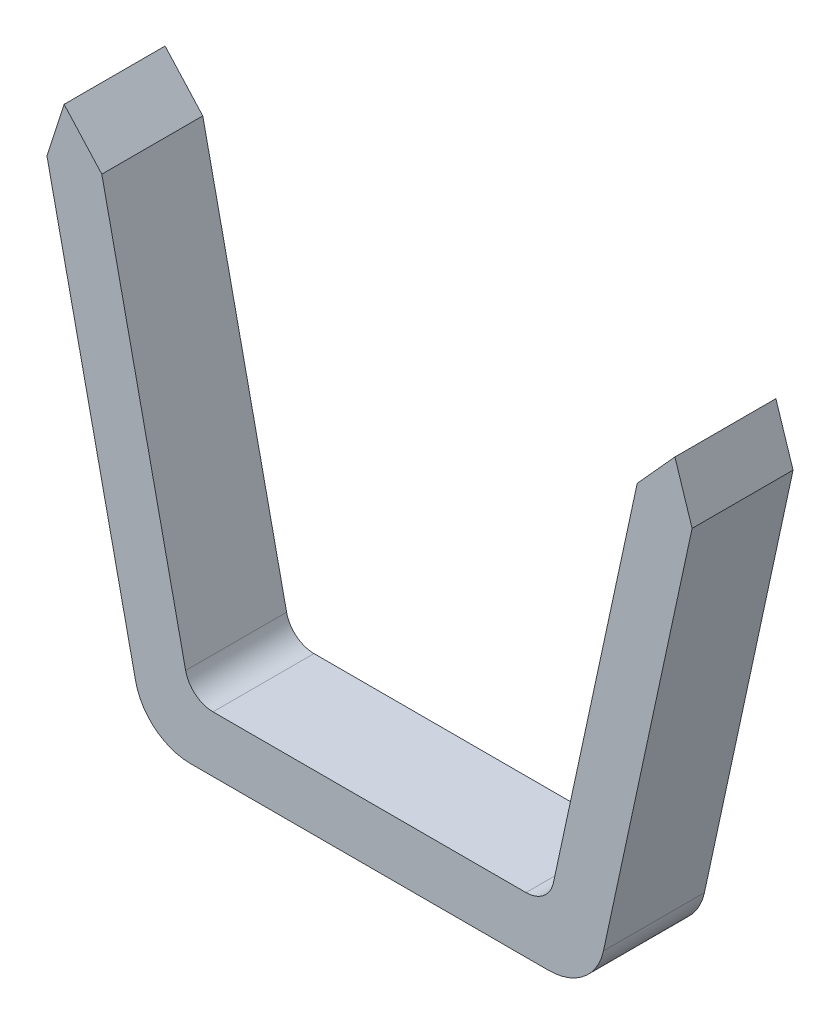
ISO-10303-21;
HEADER;
FILE_DESCRIPTION(('STEP AP214'),'2;1');
FILE_NAME('part.step','',(''),(''),'','','');
FILE_SCHEMA(('AUTOMOTIVE_DESIGN { 1 0 10303 214 1 1 1 1 }'));
ENDSEC;
DATA;
#1=APPLICATION_CONTEXT('core data for automotive mechanical design processes');
#2=APPLICATION_PROTOCOL_DEFINITION('international standard','automotive_design',2000,#1);
#3=PRODUCT_CONTEXT('',#1,'mechanical');
#4=PRODUCT('Part','Part','',(#3));
#5=PRODUCT_RELATED_PRODUCT_CATEGORY('part','',(#4));
#6=PRODUCT_DEFINITION_FORMATION('','',#4);
#7=PRODUCT_DEFINITION_CONTEXT('part definition',#1,'design');
#8=PRODUCT_DEFINITION('design','',#6,#7);
#9=PRODUCT_DEFINITION_SHAPE('','',#8);
#10=(LENGTH_UNIT() NAMED_UNIT(*) SI_UNIT(.MILLI.,.METRE.));
#11=(NAMED_UNIT(*) PLANE_ANGLE_UNIT() SI_UNIT($,.RADIAN.));
#12=(NAMED_UNIT(*) SI_UNIT($,.STERADIAN.) SOLID_ANGLE_UNIT());
#13=UNCERTAINTY_MEASURE_WITH_UNIT(LENGTH_MEASURE(1.E-05),#10,'distance_accuracy_value','');
#14=(GEOMETRIC_REPRESENTATION_CONTEXT(3) GLOBAL_UNCERTAINTY_ASSIGNED_CONTEXT((#13)) GLOBAL_UNIT_ASSIGNED_CONTEXT((#10,
#11,#12)) REPRESENTATION_CONTEXT('',''));
#15=CARTESIAN_POINT('',(0.,0.,0.));
#16=DIRECTION('',(0.,0.,1.));
#17=DIRECTION('',(1.,0.,0.));
#18=AXIS2_PLACEMENT_3D('',#15,#16,#17);
#19=CARTESIAN_POINT('',(-31.9298733487398,-112.5,18.));
#20=DIRECTION('',(0.,0.,1.));
#21=DIRECTION('',(1.,0.,0.));
#22=AXIS2_PLACEMENT_3D('',#19,#20,#21);
#23=PLANE('',#22);
#24=DIRECTION('',(0.306672532909785,-0.951815085801174,0.));
#25=VECTOR('',#24,1.);
#26=CARTESIAN_POINT('',(54.4443390688109,-31.9720104377862,18.));
#27=LINE('',#26,#25);
#28=CARTESIAN_POINT('',(54.4443390688109,-31.9720104377862,18.));
#29=VERTEX_POINT('',#28);
#30=CARTESIAN_POINT('',(57.5063561450649,-41.4755483598365,18.));
#31=VERTEX_POINT('',#30);
#32=EDGE_CURVE('E147',#29,#31,#27,.T.);
#33=ORIENTED_EDGE('',*,*,#32,.F.);
#34=DIRECTION('',(0.670959777554308,0.741493747043273,0.));
#35=VECTOR('',#34,1.);
#36=CARTESIAN_POINT('',(47.7244032118376,-39.3983727700264,18.));
#37=LINE('',#36,#35);
#38=CARTESIAN_POINT('',(47.7244032118376,-39.3983727700264,18.));
#39=VERTEX_POINT('',#38);
#40=EDGE_CURVE('E261',#39,#29,#37,.T.);
#41=ORIENTED_EDGE('',*,*,#40,.F.);
#42=DIRECTION('',(0.211189373172623,0.977445164016353,0.));
#43=VECTOR('',#42,1.);
#44=CARTESIAN_POINT('',(31.9298733487398,-112.5,18.));
#45=LINE('',#44,#43);
#46=CARTESIAN_POINT('',(32.7820358431914,-108.555946865863,18.));
#47=VERTEX_POINT('',#46);
#48=EDGE_CURVE('E221',#47,#39,#45,.T.);
#49=ORIENTED_EDGE('',*,*,#48,.F.);
#50=CARTESIAN_POINT('',(27.8948100231097,-107.5,18.));
#51=DIRECTION('',(0.,0.,1.));
#52=DIRECTION('',(1.,0.,0.));
#53=AXIS2_PLACEMENT_3D('',#50,#51,#52);
#54=CIRCLE('',#53,5.);
#55=CARTESIAN_POINT('',(27.8948100231097,-112.5,18.));
#56=VERTEX_POINT('',#55);
#57=EDGE_CURVE('E196',#47,#56,#54,.F.);
#58=ORIENTED_EDGE('',*,*,#57,.T.);
#59=DIRECTION('',(1.,0.,0.));
#60=VECTOR('',#59,1.);
#61=CARTESIAN_POINT('',(-31.9298733487398,-112.5,18.));
#62=LINE('',#61,#60);
#63=CARTESIAN_POINT('',(-27.8948100231097,-112.5,18.));
#64=VERTEX_POINT('',#63);
#65=EDGE_CURVE('E218',#64,#56,#62,.T.);
#66=ORIENTED_EDGE('',*,*,#65,.F.);
#67=CARTESIAN_POINT('',(-27.8948100231097,-107.5,18.));
#68=DIRECTION('',(0.,0.,1.));
#69=DIRECTION('',(1.,0.,0.));
#70=AXIS2_PLACEMENT_3D('',#67,#68,#69);
#71=CIRCLE('',#70,5.);
#72=CARTESIAN_POINT('',(-32.7820358431915,-108.555946865863,18.));
#73=VERTEX_POINT('',#72);
#74=EDGE_CURVE('E11',#64,#73,#71,.F.);
#75=ORIENTED_EDGE('',*,*,#74,.T.);
#76=DIRECTION('',(0.211189373172623,-0.977445164016353,0.));
#77=VECTOR('',#76,1.);
#78=CARTESIAN_POINT('',(-31.9298733487398,-112.5,18.));
#79=LINE('',#78,#77);
#80=CARTESIAN_POINT('',(-47.7236876934698,-39.4016843948391,18.));
#81=VERTEX_POINT('',#80);
#82=EDGE_CURVE('E217',#81,#73,#79,.T.);
#83=ORIENTED_EDGE('',*,*,#82,.F.);
#84=DIRECTION('',(0.67089697040122,-0.741550574881083,0.));
#85=VECTOR('',#84,1.);
#86=CARTESIAN_POINT('',(-54.4439824625953,-31.9736609139237,18.));
#87=LINE('',#86,#85);
#88=CARTESIAN_POINT('',(-54.4439824625953,-31.9736609139237,18.));
#89=VERTEX_POINT('',#88);
#90=EDGE_CURVE('E50',#89,#81,#87,.T.);
#91=ORIENTED_EDGE('',*,*,#90,.F.);
#92=DIRECTION('',(0.306753150837407,0.95178910713,0.));
#93=VECTOR('',#92,1.);
#94=CARTESIAN_POINT('',(-57.5063561450649,-41.4755483598365,18.));
#95=LINE('',#94,#93);
#96=CARTESIAN_POINT('',(-57.5063561450649,-41.4755483598365,18.));
#97=VERTEX_POINT('',#96);
#98=EDGE_CURVE('E258',#97,#89,#95,.T.);
#99=ORIENTED_EDGE('',*,*,#98,.F.);
#100=DIRECTION('',(0.211189373172623,-0.977445164016353,0.));
#101=VECTOR('',#100,1.);
#102=CARTESIAN_POINT('',(-73.3083873012264,31.6607970120533,18.));
#103=LINE('',#102,#101);
#104=CARTESIAN_POINT('',(-41.7043249889033,-114.611893731726,18.));
#105=VERTEX_POINT('',#104);
#106=EDGE_CURVE('E155',#97,#105,#103,.T.);
#107=ORIENTED_EDGE('',*,*,#106,.T.);
#108=CARTESIAN_POINT('',(-31.9298733487398,-112.5,18.));
#109=DIRECTION('',(0.,0.,1.));
#110=DIRECTION('',(1.,0.,0.));
#111=AXIS2_PLACEMENT_3D('',#108,#109,#110);
#112=CIRCLE('',#111,10.);
#113=CARTESIAN_POINT('',(-31.9298733487398,-122.5,18.));
#114=VERTEX_POINT('',#113);
#115=EDGE_CURVE('E162',#105,#114,#112,.T.);
#116=ORIENTED_EDGE('',*,*,#115,.T.);
#117=DIRECTION('',(1.,0.,0.));
#118=VECTOR('',#117,1.);
#119=CARTESIAN_POINT('',(-31.9298733487398,-122.5,18.));
#120=LINE('',#119,#118);
#121=CARTESIAN_POINT('',(31.9298733487398,-122.5,18.));
#122=VERTEX_POINT('',#121);
#123=EDGE_CURVE('E166',#114,#122,#120,.T.);
#124=ORIENTED_EDGE('',*,*,#123,.T.);
#125=CARTESIAN_POINT('',(31.9298733487398,-112.5,18.));
#126=DIRECTION('',(0.,0.,1.));
#127=DIRECTION('',(1.,0.,0.));
#128=AXIS2_PLACEMENT_3D('',#125,#126,#127);
#129=CIRCLE('',#128,10.);
#130=CARTESIAN_POINT('',(41.7043249889033,-114.611893731726,18.));
#131=VERTEX_POINT('',#130);
#132=EDGE_CURVE('E232',#122,#131,#129,.T.);
#133=ORIENTED_EDGE('',*,*,#132,.T.);
#134=DIRECTION('',(0.211189373172623,0.977445164016353,0.));
#135=VECTOR('',#134,1.);
#136=CARTESIAN_POINT('',(41.7043249889033,-114.611893731726,18.));
#137=LINE('',#136,#135);
#138=EDGE_CURVE('E234',#131,#31,#137,.T.);
#139=ORIENTED_EDGE('',*,*,#138,.T.);
#140=EDGE_LOOP('',(#33,#41,#49,#58,#66,#75,#83,#91,#99,#107,#116,#124,#133,#139));
#141=FACE_BOUND('',#140,.T.);
#142=ADVANCED_FACE('F35',(#141),#23,.T.);
#143=CARTESIAN_POINT('',(-31.9298733487398,-112.5,0.));
#144=DIRECTION('',(0.,0.,1.));
#145=DIRECTION('',(1.,0.,0.));
#146=AXIS2_PLACEMENT_3D('',#143,#144,#145);
#147=PLANE('',#146);
#148=DIRECTION('',(0.670959777554308,0.741493747043273,0.));
#149=VECTOR('',#148,1.);
#150=CARTESIAN_POINT('',(47.7244032118376,-39.3983727700264,0.));
#151=LINE('',#150,#149);
#152=CARTESIAN_POINT('',(47.7244032118376,-39.3983727700264,0.));
#153=VERTEX_POINT('',#152);
#154=CARTESIAN_POINT('',(54.4443390688109,-31.9720104377862,0.));
#155=VERTEX_POINT('',#154);
#156=EDGE_CURVE('E58',#153,#155,#151,.T.);
#157=ORIENTED_EDGE('',*,*,#156,.T.);
#158=DIRECTION('',(0.306672532909785,-0.951815085801174,0.));
#159=VECTOR('',#158,1.);
#160=CARTESIAN_POINT('',(54.4443390688109,-31.9720104377862,0.));
#161=LINE('',#160,#159);
#162=CARTESIAN_POINT('',(57.5063561450649,-41.4755483598365,0.));
#163=VERTEX_POINT('',#162);
#164=EDGE_CURVE('E156',#155,#163,#161,.T.);
#165=ORIENTED_EDGE('',*,*,#164,.T.);
#166=DIRECTION('',(0.211189373172623,0.977445164016353,0.));
#167=VECTOR('',#166,1.);
#168=CARTESIAN_POINT('',(41.7043249889033,-114.611893731726,0.));
#169=LINE('',#168,#167);
#170=CARTESIAN_POINT('',(41.7043249889033,-114.611893731726,0.));
#171=VERTEX_POINT('',#170);
#172=EDGE_CURVE('E163',#171,#163,#169,.T.);
#173=ORIENTED_EDGE('',*,*,#172,.F.);
#174=CARTESIAN_POINT('',(31.9298733487398,-112.5,0.));
#175=DIRECTION('',(0.,0.,1.));
#176=DIRECTION('',(1.,0.,0.));
#177=AXIS2_PLACEMENT_3D('',#174,#175,#176);
#178=CIRCLE('',#177,10.);
#179=CARTESIAN_POINT('',(31.9298733487398,-122.5,0.));
#180=VERTEX_POINT('',#179);
#181=EDGE_CURVE('E169',#180,#171,#178,.T.);
#182=ORIENTED_EDGE('',*,*,#181,.F.);
#183=DIRECTION('',(1.,0.,0.));
#184=VECTOR('',#183,1.);
#185=CARTESIAN_POINT('',(-31.9298733487398,-122.5,0.));
#186=LINE('',#185,#184);
#187=CARTESIAN_POINT('',(-31.9298733487398,-122.5,0.));
#188=VERTEX_POINT('',#187);
#189=EDGE_CURVE('E239',#188,#180,#186,.T.);
#190=ORIENTED_EDGE('',*,*,#189,.F.);
#191=CARTESIAN_POINT('',(-31.9298733487398,-112.5,0.));
#192=DIRECTION('',(0.,0.,1.));
#193=DIRECTION('',(1.,0.,0.));
#194=AXIS2_PLACEMENT_3D('',#191,#192,#193);
#195=CIRCLE('',#194,10.);
#196=CARTESIAN_POINT('',(-41.7043249889033,-114.611893731726,0.));
#197=VERTEX_POINT('',#196);
#198=EDGE_CURVE('E161',#197,#188,#195,.T.);
#199=ORIENTED_EDGE('',*,*,#198,.F.);
#200=DIRECTION('',(0.211189373172623,-0.977445164016353,0.));
#201=VECTOR('',#200,1.);
#202=CARTESIAN_POINT('',(-73.3083873012264,31.6607970120533,0.));
#203=LINE('',#202,#201);
#204=CARTESIAN_POINT('',(-57.5063561450649,-41.4755483598365,0.));
#205=VERTEX_POINT('',#204);
#206=EDGE_CURVE('E153',#205,#197,#203,.T.);
#207=ORIENTED_EDGE('',*,*,#206,.F.);
#208=DIRECTION('',(0.306753150837407,0.95178910713,0.));
#209=VECTOR('',#208,1.);
#210=CARTESIAN_POINT('',(-57.5063561450649,-41.4755483598365,0.));
#211=LINE('',#210,#209);
#212=CARTESIAN_POINT('',(-54.4439824625953,-31.9736609139237,0.));
#213=VERTEX_POINT('',#212);
#214=EDGE_CURVE('E135',#205,#213,#211,.T.);
#215=ORIENTED_EDGE('',*,*,#214,.T.);
#216=DIRECTION('',(0.67089697040122,-0.741550574881083,0.));
#217=VECTOR('',#216,1.);
#218=CARTESIAN_POINT('',(-54.4439824625953,-31.9736609139237,0.));
#219=LINE('',#218,#217);
#220=CARTESIAN_POINT('',(-47.7236876934698,-39.4016843948391,0.));
#221=VERTEX_POINT('',#220);
#222=EDGE_CURVE('E146',#213,#221,#219,.T.);
#223=ORIENTED_EDGE('',*,*,#222,.T.);
#224=DIRECTION('',(0.211189373172623,-0.977445164016353,0.));
#225=VECTOR('',#224,1.);
#226=CARTESIAN_POINT('',(-31.9298733487398,-112.5,0.));
#227=LINE('',#226,#225);
#228=CARTESIAN_POINT('',(-32.7820358431915,-108.555946865863,0.));
#229=VERTEX_POINT('',#228);
#230=EDGE_CURVE('E202',#221,#229,#227,.T.);
#231=ORIENTED_EDGE('',*,*,#230,.T.);
#232=CARTESIAN_POINT('',(-27.8948100231097,-107.5,0.));
#233=DIRECTION('',(0.,0.,1.));
#234=DIRECTION('',(1.,0.,0.));
#235=AXIS2_PLACEMENT_3D('',#232,#233,#234);
#236=CIRCLE('',#235,5.);
#237=CARTESIAN_POINT('',(-27.8948100231097,-112.5,0.));
#238=VERTEX_POINT('',#237);
#239=EDGE_CURVE('E43',#229,#238,#236,.T.);
#240=ORIENTED_EDGE('',*,*,#239,.T.);
#241=DIRECTION('',(1.,0.,0.));
#242=VECTOR('',#241,1.);
#243=CARTESIAN_POINT('',(-31.9298733487398,-112.5,0.));
#244=LINE('',#243,#242);
#245=CARTESIAN_POINT('',(27.8948100231097,-112.5,0.));
#246=VERTEX_POINT('',#245);
#247=EDGE_CURVE('E200',#238,#246,#244,.T.);
#248=ORIENTED_EDGE('',*,*,#247,.T.);
#249=CARTESIAN_POINT('',(27.8948100231097,-107.5,0.));
#250=DIRECTION('',(0.,0.,1.));
#251=DIRECTION('',(1.,0.,0.));
#252=AXIS2_PLACEMENT_3D('',#249,#250,#251);
#253=CIRCLE('',#252,5.);
#254=CARTESIAN_POINT('',(32.7820358431914,-108.555946865863,0.));
#255=VERTEX_POINT('',#254);
#256=EDGE_CURVE('E194',#246,#255,#253,.T.);
#257=ORIENTED_EDGE('',*,*,#256,.T.);
#258=DIRECTION('',(0.211189373172623,0.977445164016353,0.));
#259=VECTOR('',#258,1.);
#260=CARTESIAN_POINT('',(31.9298733487398,-112.5,0.));
#261=LINE('',#260,#259);
#262=EDGE_CURVE('E211',#255,#153,#261,.T.);
#263=ORIENTED_EDGE('',*,*,#262,.T.);
#264=EDGE_LOOP('',(#157,#165,#173,#182,#190,#199,#207,#215,#223,#231,#240,#248,#257,#263));
#265=FACE_BOUND('',#264,.T.);
#266=ADVANCED_FACE('F159',(#265),#147,.F.);
#267=CARTESIAN_POINT('',(-31.9298733487398,-112.5,18.));
#268=DIRECTION('',(0.,0.,-1.));
#269=DIRECTION('',(-1.,0.,0.));
#270=AXIS2_PLACEMENT_3D('',#267,#268,#269);
#271=CYLINDRICAL_SURFACE('',#270,10.);
#272=ORIENTED_EDGE('',*,*,#198,.T.);
#273=DIRECTION('',(0.,0.,-1.));
#274=VECTOR('',#273,1.);
#275=CARTESIAN_POINT('',(-31.9298733487398,-122.5,18.));
#276=LINE('',#275,#274);
#277=EDGE_CURVE('E181',#114,#188,#276,.T.);
#278=ORIENTED_EDGE('',*,*,#277,.F.);
#279=ORIENTED_EDGE('',*,*,#115,.F.);
#280=DIRECTION('',(0.,0.,-1.));
#281=VECTOR('',#280,1.);
#282=CARTESIAN_POINT('',(-41.7043249889033,-114.611893731726,18.));
#283=LINE('',#282,#281);
#284=EDGE_CURVE('E173',#105,#197,#283,.T.);
#285=ORIENTED_EDGE('',*,*,#284,.T.);
#286=EDGE_LOOP('',(#272,#278,#279,#285));
#287=FACE_BOUND('',#286,.T.);
#288=ADVANCED_FACE('F276',(#287),#271,.T.);
#289=CARTESIAN_POINT('',(-31.9298733487398,-122.5,18.));
#290=DIRECTION('',(0.,1.,0.));
#291=DIRECTION('',(0.,0.,1.));
#292=AXIS2_PLACEMENT_3D('',#289,#290,#291);
#293=PLANE('',#292);
#294=ORIENTED_EDGE('',*,*,#189,.T.);
#295=DIRECTION('',(0.,0.,-1.));
#296=VECTOR('',#295,1.);
#297=CARTESIAN_POINT('',(31.9298733487398,-122.5,18.));
#298=LINE('',#297,#296);
#299=EDGE_CURVE('E178',#122,#180,#298,.T.);
#300=ORIENTED_EDGE('',*,*,#299,.F.);
#301=ORIENTED_EDGE('',*,*,#123,.F.);
#302=ORIENTED_EDGE('',*,*,#277,.T.);
#303=EDGE_LOOP('',(#294,#300,#301,#302));
#304=FACE_BOUND('',#303,.T.);
#305=ADVANCED_FACE('F278',(#304),#293,.F.);
#306=CARTESIAN_POINT('',(31.9298733487398,-112.5,18.));
#307=DIRECTION('',(0.,0.,-1.));
#308=DIRECTION('',(-1.,0.,0.));
#309=AXIS2_PLACEMENT_3D('',#306,#307,#308);
#310=CYLINDRICAL_SURFACE('',#309,10.);
#311=ORIENTED_EDGE('',*,*,#181,.T.);
#312=DIRECTION('',(0.,0.,-1.));
#313=VECTOR('',#312,1.);
#314=CARTESIAN_POINT('',(41.7043249889033,-114.611893731726,18.));
#315=LINE('',#314,#313);
#316=EDGE_CURVE('E175',#131,#171,#315,.T.);
#317=ORIENTED_EDGE('',*,*,#316,.F.);
#318=ORIENTED_EDGE('',*,*,#132,.F.);
#319=ORIENTED_EDGE('',*,*,#299,.T.);
#320=EDGE_LOOP('',(#311,#317,#318,#319));
#321=FACE_BOUND('',#320,.T.);
#322=ADVANCED_FACE('F243',(#321),#310,.T.);
#323=CARTESIAN_POINT('',(41.7043249889033,-114.611893731726,18.));
#324=DIRECTION('',(-0.977445164016353,0.211189373172623,0.));
#325=DIRECTION('',(-0.211189373172623,-0.977445164016353,0.));
#326=AXIS2_PLACEMENT_3D('',#323,#324,#325);
#327=PLANE('',#326);
#328=ORIENTED_EDGE('',*,*,#172,.T.);
#329=DIRECTION('',(0.,0.,1.));
#330=VECTOR('',#329,1.);
#331=CARTESIAN_POINT('',(57.5063561450649,-41.4755483598365,0.));
#332=LINE('',#331,#330);
#333=EDGE_CURVE('E227',#163,#31,#332,.T.);
#334=ORIENTED_EDGE('',*,*,#333,.T.);
#335=ORIENTED_EDGE('',*,*,#138,.F.);
#336=ORIENTED_EDGE('',*,*,#316,.T.);
#337=EDGE_LOOP('',(#328,#334,#335,#336));
#338=FACE_BOUND('',#337,.T.);
#339=ADVANCED_FACE('F249',(#338),#327,.F.);
#340=CARTESIAN_POINT('',(-73.3083873012264,31.6607970120533,18.));
#341=DIRECTION('',(0.977445164016353,0.211189373172623,0.));
#342=DIRECTION('',(-0.211189373172623,0.977445164016353,0.));
#343=AXIS2_PLACEMENT_3D('',#340,#341,#342);
#344=PLANE('',#343);
#345=ORIENTED_EDGE('',*,*,#106,.F.);
#346=DIRECTION('',(0.,0.,1.));
#347=VECTOR('',#346,1.);
#348=CARTESIAN_POINT('',(-57.5063561450649,-41.4755483598365,0.));
#349=LINE('',#348,#347);
#350=EDGE_CURVE('E139',#205,#97,#349,.T.);
#351=ORIENTED_EDGE('',*,*,#350,.F.);
#352=ORIENTED_EDGE('',*,*,#206,.T.);
#353=ORIENTED_EDGE('',*,*,#284,.F.);
#354=EDGE_LOOP('',(#345,#351,#352,#353));
#355=FACE_BOUND('',#354,.T.);
#356=ADVANCED_FACE('F151',(#355),#344,.F.);
#357=CARTESIAN_POINT('',(-31.9298733487398,-112.5,18.));
#358=DIRECTION('',(0.977445164016353,0.211189373172623,0.));
#359=DIRECTION('',(-0.211189373172623,0.977445164016353,0.));
#360=AXIS2_PLACEMENT_3D('',#357,#358,#359);
#361=PLANE('',#360);
#362=DIRECTION('',(0.,0.,1.));
#363=VECTOR('',#362,1.);
#364=CARTESIAN_POINT('',(-47.7236876934698,-39.4016843948391,0.));
#365=LINE('',#364,#363);
#366=EDGE_CURVE('E270',#221,#81,#365,.T.);
#367=ORIENTED_EDGE('',*,*,#366,.T.);
#368=ORIENTED_EDGE('',*,*,#82,.T.);
#369=DIRECTION('',(0.,0.,-1.));
#370=VECTOR('',#369,1.);
#371=CARTESIAN_POINT('',(-32.7820358431915,-108.555946865863,0.));
#372=LINE('',#371,#370);
#373=EDGE_CURVE('E191',#73,#229,#372,.T.);
#374=ORIENTED_EDGE('',*,*,#373,.T.);
#375=ORIENTED_EDGE('',*,*,#230,.F.);
#376=EDGE_LOOP('',(#367,#368,#374,#375));
#377=FACE_BOUND('',#376,.T.);
#378=ADVANCED_FACE('F302',(#377),#361,.T.);
#379=CARTESIAN_POINT('',(-31.9298733487398,-112.5,18.));
#380=DIRECTION('',(0.,1.,0.));
#381=DIRECTION('',(0.,0.,1.));
#382=AXIS2_PLACEMENT_3D('',#379,#380,#381);
#383=PLANE('',#382);
#384=ORIENTED_EDGE('',*,*,#65,.T.);
#385=DIRECTION('',(0.,0.,-1.));
#386=VECTOR('',#385,1.);
#387=CARTESIAN_POINT('',(27.8948100231097,-112.5,0.));
#388=LINE('',#387,#386);
#389=EDGE_CURVE('E186',#56,#246,#388,.T.);
#390=ORIENTED_EDGE('',*,*,#389,.T.);
#391=ORIENTED_EDGE('',*,*,#247,.F.);
#392=DIRECTION('',(0.,0.,-1.));
#393=VECTOR('',#392,1.);
#394=CARTESIAN_POINT('',(-27.8948100231097,-112.5,18.));
#395=LINE('',#394,#393);
#396=EDGE_CURVE('E184',#238,#64,#395,.F.);
#397=ORIENTED_EDGE('',*,*,#396,.T.);
#398=EDGE_LOOP('',(#384,#390,#391,#397));
#399=FACE_BOUND('',#398,.T.);
#400=ADVANCED_FACE('F208',(#399),#383,.T.);
#401=CARTESIAN_POINT('',(31.9298733487398,-112.5,18.));
#402=DIRECTION('',(-0.977445164016353,0.211189373172623,0.));
#403=DIRECTION('',(-0.211189373172623,-0.977445164016353,0.));
#404=AXIS2_PLACEMENT_3D('',#401,#402,#403);
#405=PLANE('',#404);
#406=DIRECTION('',(0.,0.,1.));
#407=VECTOR('',#406,1.);
#408=CARTESIAN_POINT('',(47.7244032118376,-39.3983727700264,0.));
#409=LINE('',#408,#407);
#410=EDGE_CURVE('E268',#153,#39,#409,.T.);
#411=ORIENTED_EDGE('',*,*,#410,.F.);
#412=ORIENTED_EDGE('',*,*,#262,.F.);
#413=DIRECTION('',(0.,0.,-1.));
#414=VECTOR('',#413,1.);
#415=CARTESIAN_POINT('',(32.7820358431914,-108.555946865863,18.));
#416=LINE('',#415,#414);
#417=EDGE_CURVE('E189',#255,#47,#416,.F.);
#418=ORIENTED_EDGE('',*,*,#417,.T.);
#419=ORIENTED_EDGE('',*,*,#48,.T.);
#420=EDGE_LOOP('',(#411,#412,#418,#419));
#421=FACE_BOUND('',#420,.T.);
#422=ADVANCED_FACE('F284',(#421),#405,.T.);
#423=CARTESIAN_POINT('',(27.8948100231097,-107.5,18.));
#424=DIRECTION('',(0.,0.,1.));
#425=DIRECTION('',(1.,0.,0.));
#426=AXIS2_PLACEMENT_3D('',#423,#424,#425);
#427=CYLINDRICAL_SURFACE('',#426,5.);
#428=ORIENTED_EDGE('',*,*,#57,.F.);
#429=ORIENTED_EDGE('',*,*,#417,.F.);
#430=ORIENTED_EDGE('',*,*,#256,.F.);
#431=ORIENTED_EDGE('',*,*,#389,.F.);
#432=EDGE_LOOP('',(#428,#429,#430,#431));
#433=FACE_BOUND('',#432,.T.);
#434=ADVANCED_FACE('F287',(#433),#427,.F.);
#435=CARTESIAN_POINT('',(-27.8948100231097,-107.5,18.));
#436=DIRECTION('',(0.,0.,1.));
#437=DIRECTION('',(1.,0.,0.));
#438=AXIS2_PLACEMENT_3D('',#435,#436,#437);
#439=CYLINDRICAL_SURFACE('',#438,5.);
#440=ORIENTED_EDGE('',*,*,#74,.F.);
#441=ORIENTED_EDGE('',*,*,#396,.F.);
#442=ORIENTED_EDGE('',*,*,#239,.F.);
#443=ORIENTED_EDGE('',*,*,#373,.F.);
#444=EDGE_LOOP('',(#440,#441,#442,#443));
#445=FACE_BOUND('',#444,.T.);
#446=ADVANCED_FACE('F37',(#445),#439,.F.);
#447=CARTESIAN_POINT('',(47.7244032118376,-39.3983727700264,0.));
#448=DIRECTION('',(0.741493747043273,-0.670959777554308,0.));
#449=DIRECTION('',(0.670959777554308,0.741493747043273,0.));
#450=AXIS2_PLACEMENT_3D('',#447,#448,#449);
#451=PLANE('',#450);
#452=ORIENTED_EDGE('',*,*,#40,.T.);
#453=DIRECTION('',(0.,0.,1.));
#454=VECTOR('',#453,1.);
#455=CARTESIAN_POINT('',(54.4443390688109,-31.9720104377862,0.));
#456=LINE('',#455,#454);
#457=EDGE_CURVE('E266',#155,#29,#456,.T.);
#458=ORIENTED_EDGE('',*,*,#457,.F.);
#459=ORIENTED_EDGE('',*,*,#156,.F.);
#460=ORIENTED_EDGE('',*,*,#410,.T.);
#461=EDGE_LOOP('',(#452,#458,#459,#460));
#462=FACE_BOUND('',#461,.T.);
#463=ADVANCED_FACE('F281',(#462),#451,.F.);
#464=CARTESIAN_POINT('',(54.4443390688109,-31.9720104377862,0.));
#465=DIRECTION('',(-0.951815085801174,-0.306672532909785,0.));
#466=DIRECTION('',(0.306672532909785,-0.951815085801174,0.));
#467=AXIS2_PLACEMENT_3D('',#464,#465,#466);
#468=PLANE('',#467);
#469=ORIENTED_EDGE('',*,*,#32,.T.);
#470=ORIENTED_EDGE('',*,*,#333,.F.);
#471=ORIENTED_EDGE('',*,*,#164,.F.);
#472=ORIENTED_EDGE('',*,*,#457,.T.);
#473=EDGE_LOOP('',(#469,#470,#471,#472));
#474=FACE_BOUND('',#473,.T.);
#475=ADVANCED_FACE('F280',(#474),#468,.F.);
#476=CARTESIAN_POINT('',(-54.4439824625953,-31.9736609139237,0.));
#477=DIRECTION('',(-0.741550574881083,-0.670896970401219,0.));
#478=DIRECTION('',(0.67089697040122,-0.741550574881083,0.));
#479=AXIS2_PLACEMENT_3D('',#476,#477,#478);
#480=PLANE('',#479);
#481=ORIENTED_EDGE('',*,*,#90,.T.);
#482=ORIENTED_EDGE('',*,*,#366,.F.);
#483=ORIENTED_EDGE('',*,*,#222,.F.);
#484=DIRECTION('',(0.,0.,1.));
#485=VECTOR('',#484,1.);
#486=CARTESIAN_POINT('',(-54.4439824625953,-31.9736609139237,0.));
#487=LINE('',#486,#485);
#488=EDGE_CURVE('E141',#213,#89,#487,.T.);
#489=ORIENTED_EDGE('',*,*,#488,.T.);
#490=EDGE_LOOP('',(#481,#482,#483,#489));
#491=FACE_BOUND('',#490,.T.);
#492=ADVANCED_FACE('F272',(#491),#480,.F.);
#493=CARTESIAN_POINT('',(-57.5063561450649,-41.4755483598365,0.));
#494=DIRECTION('',(0.95178910713,-0.306753150837407,0.));
#495=DIRECTION('',(0.306753150837407,0.95178910713,0.));
#496=AXIS2_PLACEMENT_3D('',#493,#494,#495);
#497=PLANE('',#496);
#498=ORIENTED_EDGE('',*,*,#98,.T.);
#499=ORIENTED_EDGE('',*,*,#488,.F.);
#500=ORIENTED_EDGE('',*,*,#214,.F.);
#501=ORIENTED_EDGE('',*,*,#350,.T.);
#502=EDGE_LOOP('',(#498,#499,#500,#501));
#503=FACE_BOUND('',#502,.T.);
#504=ADVANCED_FACE('F138',(#503),#497,.F.);
#505=CLOSED_SHELL('',(#142,#266,#288,#305,#322,#339,#356,#378,#400,#422,#434,#446,#463,#475,
#492,#504));
#506=MANIFOLD_SOLID_BREP('B2',#505);
#507=ADVANCED_BREP_SHAPE_REPRESENTATION('',(#18,#506),#14);
#508=SHAPE_DEFINITION_REPRESENTATION(#9,#507);
ENDSEC;
END-ISO-10303-21;
